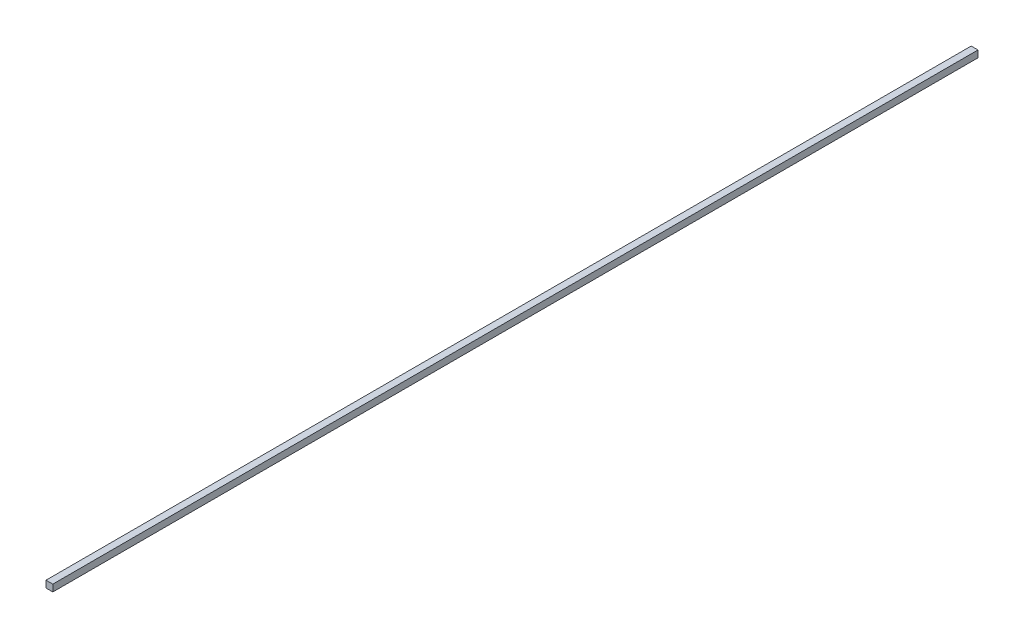
ISO-10303-21;
HEADER;
FILE_DESCRIPTION(('STEP AP214'),'2;1');
FILE_NAME('part.step','',(''),(''),'','','');
FILE_SCHEMA(('AUTOMOTIVE_DESIGN { 1 0 10303 214 1 1 1 1 }'));
ENDSEC;
DATA;
#1=APPLICATION_CONTEXT('core data for automotive mechanical design processes');
#2=APPLICATION_PROTOCOL_DEFINITION('international standard','automotive_design',2000,#1);
#3=PRODUCT_CONTEXT('',#1,'mechanical');
#4=PRODUCT('Part','Part','',(#3));
#5=PRODUCT_RELATED_PRODUCT_CATEGORY('part','',(#4));
#6=PRODUCT_DEFINITION_FORMATION('','',#4);
#7=PRODUCT_DEFINITION_CONTEXT('part definition',#1,'design');
#8=PRODUCT_DEFINITION('design','',#6,#7);
#9=PRODUCT_DEFINITION_SHAPE('','',#8);
#10=(LENGTH_UNIT() NAMED_UNIT(*) SI_UNIT(.MILLI.,.METRE.));
#11=(NAMED_UNIT(*) PLANE_ANGLE_UNIT() SI_UNIT($,.RADIAN.));
#12=(NAMED_UNIT(*) SI_UNIT($,.STERADIAN.) SOLID_ANGLE_UNIT());
#13=UNCERTAINTY_MEASURE_WITH_UNIT(LENGTH_MEASURE(1.E-05),#10,'distance_accuracy_value','');
#14=(GEOMETRIC_REPRESENTATION_CONTEXT(3) GLOBAL_UNCERTAINTY_ASSIGNED_CONTEXT((#13)) GLOBAL_UNIT_ASSIGNED_CONTEXT((#10,
#11,#12)) REPRESENTATION_CONTEXT('',''));
#15=CARTESIAN_POINT('',(0.,0.,0.));
#16=DIRECTION('',(0.,0.,1.));
#17=DIRECTION('',(1.,0.,0.));
#18=AXIS2_PLACEMENT_3D('',#15,#16,#17);
#19=CARTESIAN_POINT('',(0.,0.,4750.));
#20=DIRECTION('',(1.,0.,0.));
#21=DIRECTION('',(0.,0.,-1.));
#22=AXIS2_PLACEMENT_3D('',#19,#20,#21);
#23=PLANE('',#22);
#24=DIRECTION('',(0.,-1.,0.));
#25=VECTOR('',#24,1.);
#26=CARTESIAN_POINT('',(0.,0.,0.));
#27=LINE('',#26,#25);
#28=CARTESIAN_POINT('',(0.,35.,0.));
#29=VERTEX_POINT('',#28);
#30=CARTESIAN_POINT('',(0.,0.,0.));
#31=VERTEX_POINT('',#30);
#32=EDGE_CURVE('E100',#29,#31,#27,.T.);
#33=ORIENTED_EDGE('',*,*,#32,.T.);
#34=DIRECTION('',(0.,0.,-1.));
#35=VECTOR('',#34,1.);
#36=CARTESIAN_POINT('',(0.,0.,4750.));
#37=LINE('',#36,#35);
#38=CARTESIAN_POINT('',(0.,0.,4750.));
#39=VERTEX_POINT('',#38);
#40=EDGE_CURVE('E11',#39,#31,#37,.T.);
#41=ORIENTED_EDGE('',*,*,#40,.F.);
#42=DIRECTION('',(0.,-1.,0.));
#43=VECTOR('',#42,1.);
#44=CARTESIAN_POINT('',(0.,0.,4750.));
#45=LINE('',#44,#43);
#46=CARTESIAN_POINT('',(0.,35.,4750.));
#47=VERTEX_POINT('',#46);
#48=EDGE_CURVE('E88',#47,#39,#45,.T.);
#49=ORIENTED_EDGE('',*,*,#48,.F.);
#50=DIRECTION('',(0.,0.,-1.));
#51=VECTOR('',#50,1.);
#52=CARTESIAN_POINT('',(0.,35.,4750.));
#53=LINE('',#52,#51);
#54=EDGE_CURVE('E96',#47,#29,#53,.T.);
#55=ORIENTED_EDGE('',*,*,#54,.T.);
#56=EDGE_LOOP('',(#33,#41,#49,#55));
#57=FACE_BOUND('',#56,.T.);
#58=ADVANCED_FACE('F37',(#57),#23,.F.);
#59=CARTESIAN_POINT('',(0.,0.,4750.));
#60=DIRECTION('',(0.,1.,0.));
#61=DIRECTION('',(0.,0.,1.));
#62=AXIS2_PLACEMENT_3D('',#59,#60,#61);
#63=PLANE('',#62);
#64=DIRECTION('',(1.,0.,0.));
#65=VECTOR('',#64,1.);
#66=CARTESIAN_POINT('',(0.,0.,0.));
#67=LINE('',#66,#65);
#68=CARTESIAN_POINT('',(35.,0.,0.));
#69=VERTEX_POINT('',#68);
#70=EDGE_CURVE('E92',#31,#69,#67,.T.);
#71=ORIENTED_EDGE('',*,*,#70,.T.);
#72=DIRECTION('',(0.,0.,-1.));
#73=VECTOR('',#72,1.);
#74=CARTESIAN_POINT('',(35.,0.,4750.));
#75=LINE('',#74,#73);
#76=CARTESIAN_POINT('',(35.,0.,4750.));
#77=VERTEX_POINT('',#76);
#78=EDGE_CURVE('E45',#77,#69,#75,.T.);
#79=ORIENTED_EDGE('',*,*,#78,.F.);
#80=DIRECTION('',(1.,0.,0.));
#81=VECTOR('',#80,1.);
#82=CARTESIAN_POINT('',(0.,0.,4750.));
#83=LINE('',#82,#81);
#84=EDGE_CURVE('E83',#39,#77,#83,.T.);
#85=ORIENTED_EDGE('',*,*,#84,.F.);
#86=ORIENTED_EDGE('',*,*,#40,.T.);
#87=EDGE_LOOP('',(#71,#79,#85,#86));
#88=FACE_BOUND('',#87,.T.);
#89=ADVANCED_FACE('F91',(#88),#63,.F.);
#90=CARTESIAN_POINT('',(35.,0.,4750.));
#91=DIRECTION('',(-1.,0.,0.));
#92=DIRECTION('',(0.,0.,1.));
#93=AXIS2_PLACEMENT_3D('',#90,#91,#92);
#94=PLANE('',#93);
#95=DIRECTION('',(0.,1.,0.));
#96=VECTOR('',#95,1.);
#97=CARTESIAN_POINT('',(35.,0.,0.));
#98=LINE('',#97,#96);
#99=CARTESIAN_POINT('',(35.,35.,0.));
#100=VERTEX_POINT('',#99);
#101=EDGE_CURVE('E70',#69,#100,#98,.T.);
#102=ORIENTED_EDGE('',*,*,#101,.T.);
#103=DIRECTION('',(0.,0.,-1.));
#104=VECTOR('',#103,1.);
#105=CARTESIAN_POINT('',(35.,35.,4750.));
#106=LINE('',#105,#104);
#107=CARTESIAN_POINT('',(35.,35.,4750.));
#108=VERTEX_POINT('',#107);
#109=EDGE_CURVE('E93',#108,#100,#106,.T.);
#110=ORIENTED_EDGE('',*,*,#109,.F.);
#111=DIRECTION('',(0.,1.,0.));
#112=VECTOR('',#111,1.);
#113=CARTESIAN_POINT('',(35.,0.,4750.));
#114=LINE('',#113,#112);
#115=EDGE_CURVE('E86',#77,#108,#114,.T.);
#116=ORIENTED_EDGE('',*,*,#115,.F.);
#117=ORIENTED_EDGE('',*,*,#78,.T.);
#118=EDGE_LOOP('',(#102,#110,#116,#117));
#119=FACE_BOUND('',#118,.T.);
#120=ADVANCED_FACE('F94',(#119),#94,.F.);
#121=CARTESIAN_POINT('',(0.,35.,4750.));
#122=DIRECTION('',(0.,-1.,0.));
#123=DIRECTION('',(0.,0.,-1.));
#124=AXIS2_PLACEMENT_3D('',#121,#122,#123);
#125=PLANE('',#124);
#126=DIRECTION('',(-1.,0.,0.));
#127=VECTOR('',#126,1.);
#128=CARTESIAN_POINT('',(0.,35.,0.));
#129=LINE('',#128,#127);
#130=EDGE_CURVE('E76',#100,#29,#129,.T.);
#131=ORIENTED_EDGE('',*,*,#130,.T.);
#132=ORIENTED_EDGE('',*,*,#54,.F.);
#133=DIRECTION('',(-1.,0.,0.));
#134=VECTOR('',#133,1.);
#135=CARTESIAN_POINT('',(0.,35.,4750.));
#136=LINE('',#135,#134);
#137=EDGE_CURVE('E53',#108,#47,#136,.T.);
#138=ORIENTED_EDGE('',*,*,#137,.F.);
#139=ORIENTED_EDGE('',*,*,#109,.T.);
#140=EDGE_LOOP('',(#131,#132,#138,#139));
#141=FACE_BOUND('',#140,.T.);
#142=ADVANCED_FACE('F107',(#141),#125,.F.);
#143=CARTESIAN_POINT('',(0.,0.,4750.));
#144=DIRECTION('',(0.,0.,-1.));
#145=DIRECTION('',(-1.,0.,0.));
#146=AXIS2_PLACEMENT_3D('',#143,#144,#145);
#147=PLANE('',#146);
#148=ORIENTED_EDGE('',*,*,#48,.T.);
#149=ORIENTED_EDGE('',*,*,#84,.T.);
#150=ORIENTED_EDGE('',*,*,#115,.T.);
#151=ORIENTED_EDGE('',*,*,#137,.T.);
#152=EDGE_LOOP('',(#148,#149,#150,#151));
#153=FACE_BOUND('',#152,.T.);
#154=ADVANCED_FACE('F84',(#153),#147,.F.);
#155=CARTESIAN_POINT('',(0.,0.,0.));
#156=DIRECTION('',(0.,0.,-1.));
#157=DIRECTION('',(-1.,0.,0.));
#158=AXIS2_PLACEMENT_3D('',#155,#156,#157);
#159=PLANE('',#158);
#160=ORIENTED_EDGE('',*,*,#32,.F.);
#161=ORIENTED_EDGE('',*,*,#130,.F.);
#162=ORIENTED_EDGE('',*,*,#101,.F.);
#163=ORIENTED_EDGE('',*,*,#70,.F.);
#164=EDGE_LOOP('',(#160,#161,#162,#163));
#165=FACE_BOUND('',#164,.T.);
#166=ADVANCED_FACE('F110',(#165),#159,.T.);
#167=CLOSED_SHELL('',(#58,#89,#120,#142,#154,#166));
#168=MANIFOLD_SOLID_BREP('B2',#167);
#169=ADVANCED_BREP_SHAPE_REPRESENTATION('',(#18,#168),#14);
#170=SHAPE_DEFINITION_REPRESENTATION(#9,#169);
ENDSEC;
END-ISO-10303-21;
